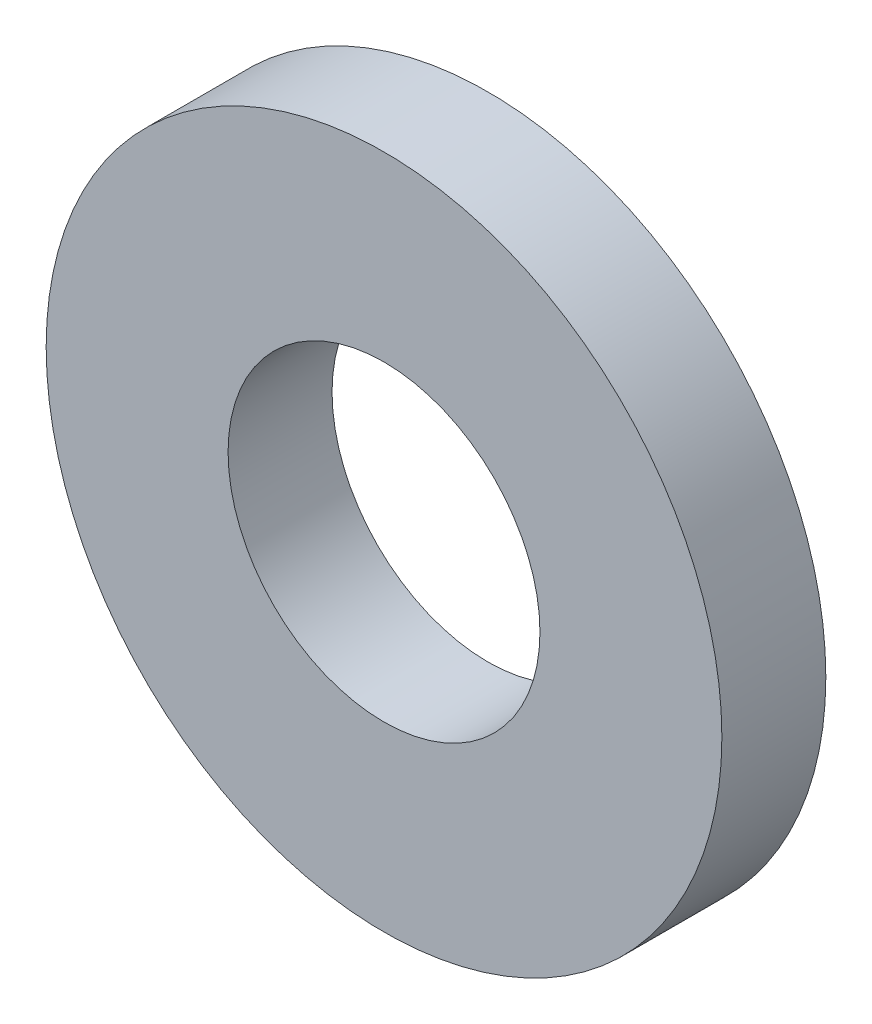
ISO-10303-21;
HEADER;
FILE_DESCRIPTION(('STEP AP214'),'2;1');
FILE_NAME('part.step','',(''),(''),'','','');
FILE_SCHEMA(('AUTOMOTIVE_DESIGN { 1 0 10303 214 1 1 1 1 }'));
ENDSEC;
DATA;
#1=APPLICATION_CONTEXT('core data for automotive mechanical design processes');
#2=APPLICATION_PROTOCOL_DEFINITION('international standard','automotive_design',2000,#1);
#3=PRODUCT_CONTEXT('',#1,'mechanical');
#4=PRODUCT('Part','Part','',(#3));
#5=PRODUCT_RELATED_PRODUCT_CATEGORY('part','',(#4));
#6=PRODUCT_DEFINITION_FORMATION('','',#4);
#7=PRODUCT_DEFINITION_CONTEXT('part definition',#1,'design');
#8=PRODUCT_DEFINITION('design','',#6,#7);
#9=PRODUCT_DEFINITION_SHAPE('','',#8);
#10=(LENGTH_UNIT() NAMED_UNIT(*) SI_UNIT(.MILLI.,.METRE.));
#11=(NAMED_UNIT(*) PLANE_ANGLE_UNIT() SI_UNIT($,.RADIAN.));
#12=(NAMED_UNIT(*) SI_UNIT($,.STERADIAN.) SOLID_ANGLE_UNIT());
#13=UNCERTAINTY_MEASURE_WITH_UNIT(LENGTH_MEASURE(1.E-05),#10,'distance_accuracy_value','');
#14=(GEOMETRIC_REPRESENTATION_CONTEXT(3) GLOBAL_UNCERTAINTY_ASSIGNED_CONTEXT((#13)) GLOBAL_UNIT_ASSIGNED_CONTEXT((#10,
#11,#12)) REPRESENTATION_CONTEXT('',''));
#15=CARTESIAN_POINT('',(0.,0.,0.));
#16=DIRECTION('',(0.,0.,1.));
#17=DIRECTION('',(1.,0.,0.));
#18=AXIS2_PLACEMENT_3D('',#15,#16,#17);
#19=CARTESIAN_POINT('',(0.,0.,12.7));
#20=DIRECTION('',(0.,0.,1.));
#21=DIRECTION('',(1.,0.,0.));
#22=AXIS2_PLACEMENT_3D('',#19,#20,#21);
#23=PLANE('',#22);
#24=CARTESIAN_POINT('',(0.,0.,12.7));
#25=DIRECTION('',(0.,0.,1.));
#26=DIRECTION('',(1.,0.,0.));
#27=AXIS2_PLACEMENT_3D('',#24,#25,#26);
#28=CIRCLE('',#27,41.275);
#29=CARTESIAN_POINT('',(41.275,0.,12.7));
#30=VERTEX_POINT('',#29);
#31=EDGE_CURVE('E10',#30,#30,#28,.T.);
#32=ORIENTED_EDGE('',*,*,#31,.T.);
#33=EDGE_LOOP('',(#32));
#34=FACE_BOUND('',#33,.T.);
#35=CARTESIAN_POINT('',(0.,0.,12.7));
#36=DIRECTION('',(0.,0.,1.));
#37=DIRECTION('',(1.,0.,0.));
#38=AXIS2_PLACEMENT_3D('',#35,#36,#37);
#39=CIRCLE('',#38,19.05);
#40=CARTESIAN_POINT('',(19.05,0.,12.7));
#41=VERTEX_POINT('',#40);
#42=EDGE_CURVE('E50',#41,#41,#39,.T.);
#43=ORIENTED_EDGE('',*,*,#42,.F.);
#44=EDGE_LOOP('',(#43));
#45=FACE_BOUND('',#44,.T.);
#46=ADVANCED_FACE('F37',(#34,#45),#23,.T.);
#47=CARTESIAN_POINT('',(0.,0.,0.));
#48=DIRECTION('',(0.,0.,1.));
#49=DIRECTION('',(1.,0.,0.));
#50=AXIS2_PLACEMENT_3D('',#47,#48,#49);
#51=PLANE('',#50);
#52=CARTESIAN_POINT('',(0.,0.,0.));
#53=DIRECTION('',(0.,0.,1.));
#54=DIRECTION('',(1.,0.,0.));
#55=AXIS2_PLACEMENT_3D('',#52,#53,#54);
#56=CIRCLE('',#55,41.275);
#57=CARTESIAN_POINT('',(41.275,0.,0.));
#58=VERTEX_POINT('',#57);
#59=EDGE_CURVE('E41',#58,#58,#56,.T.);
#60=ORIENTED_EDGE('',*,*,#59,.F.);
#61=EDGE_LOOP('',(#60));
#62=FACE_BOUND('',#61,.T.);
#63=CARTESIAN_POINT('',(0.,0.,0.));
#64=DIRECTION('',(0.,0.,1.));
#65=DIRECTION('',(1.,0.,0.));
#66=AXIS2_PLACEMENT_3D('',#63,#64,#65);
#67=CIRCLE('',#66,19.05);
#68=CARTESIAN_POINT('',(19.05,0.,0.));
#69=VERTEX_POINT('',#68);
#70=EDGE_CURVE('E52',#69,#69,#67,.T.);
#71=ORIENTED_EDGE('',*,*,#70,.T.);
#72=EDGE_LOOP('',(#71));
#73=FACE_BOUND('',#72,.T.);
#74=ADVANCED_FACE('F64',(#62,#73),#51,.F.);
#75=CARTESIAN_POINT('',(0.,0.,12.7));
#76=DIRECTION('',(0.,0.,-1.));
#77=DIRECTION('',(-1.,0.,0.));
#78=AXIS2_PLACEMENT_3D('',#75,#76,#77);
#79=CYLINDRICAL_SURFACE('',#78,41.275);
#80=ORIENTED_EDGE('',*,*,#31,.F.);
#81=EDGE_LOOP('',(#80));
#82=FACE_BOUND('',#81,.T.);
#83=ORIENTED_EDGE('',*,*,#59,.T.);
#84=EDGE_LOOP('',(#83));
#85=FACE_BOUND('',#84,.T.);
#86=ADVANCED_FACE('F39',(#82,#85),#79,.T.);
#87=CARTESIAN_POINT('',(0.,0.,12.7));
#88=DIRECTION('',(0.,0.,-1.));
#89=DIRECTION('',(-1.,0.,0.));
#90=AXIS2_PLACEMENT_3D('',#87,#88,#89);
#91=CYLINDRICAL_SURFACE('',#90,19.05);
#92=ORIENTED_EDGE('',*,*,#42,.T.);
#93=EDGE_LOOP('',(#92));
#94=FACE_BOUND('',#93,.T.);
#95=ORIENTED_EDGE('',*,*,#70,.F.);
#96=EDGE_LOOP('',(#95));
#97=FACE_BOUND('',#96,.T.);
#98=ADVANCED_FACE('F60',(#94,#97),#91,.F.);
#99=CLOSED_SHELL('',(#46,#74,#86,#98));
#100=MANIFOLD_SOLID_BREP('B2',#99);
#101=ADVANCED_BREP_SHAPE_REPRESENTATION('',(#18,#100),#14);
#102=SHAPE_DEFINITION_REPRESENTATION(#9,#101);
ENDSEC;
END-ISO-10303-21;
